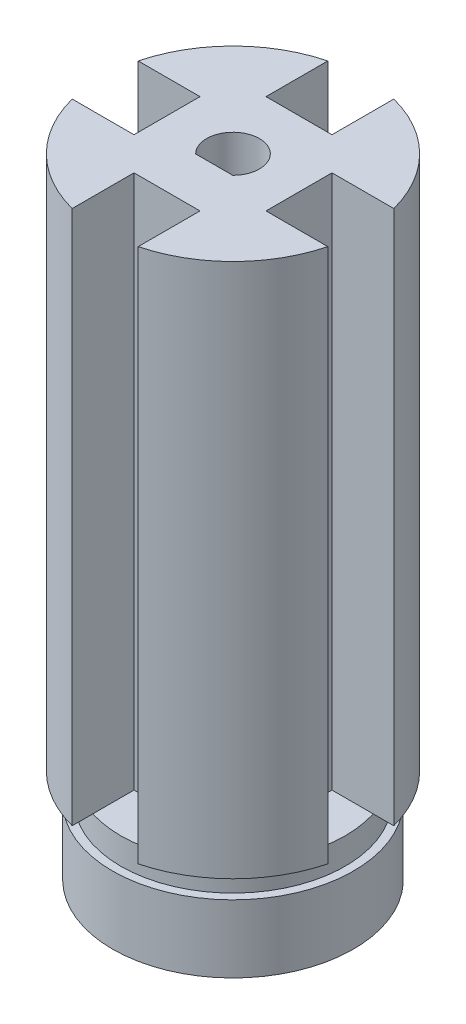
ISO-10303-21;
HEADER;
FILE_DESCRIPTION(('STEP AP214'),'2;1');
FILE_NAME('part.step','',(''),(''),'','','');
FILE_SCHEMA(('AUTOMOTIVE_DESIGN { 1 0 10303 214 1 1 1 1 }'));
ENDSEC;
DATA;
#1=APPLICATION_CONTEXT('core data for automotive mechanical design processes');
#2=APPLICATION_PROTOCOL_DEFINITION('international standard','automotive_design',2000,#1);
#3=PRODUCT_CONTEXT('',#1,'mechanical');
#4=PRODUCT('Part','Part','',(#3));
#5=PRODUCT_RELATED_PRODUCT_CATEGORY('part','',(#4));
#6=PRODUCT_DEFINITION_FORMATION('','',#4);
#7=PRODUCT_DEFINITION_CONTEXT('part definition',#1,'design');
#8=PRODUCT_DEFINITION('design','',#6,#7);
#9=PRODUCT_DEFINITION_SHAPE('','',#8);
#10=(LENGTH_UNIT() NAMED_UNIT(*) SI_UNIT(.MILLI.,.METRE.));
#11=(NAMED_UNIT(*) PLANE_ANGLE_UNIT() SI_UNIT($,.RADIAN.));
#12=(NAMED_UNIT(*) SI_UNIT($,.STERADIAN.) SOLID_ANGLE_UNIT());
#13=UNCERTAINTY_MEASURE_WITH_UNIT(LENGTH_MEASURE(1.E-05),#10,'distance_accuracy_value','');
#14=(GEOMETRIC_REPRESENTATION_CONTEXT(3) GLOBAL_UNCERTAINTY_ASSIGNED_CONTEXT((#13)) GLOBAL_UNIT_ASSIGNED_CONTEXT((#10,
#11,#12)) REPRESENTATION_CONTEXT('',''));
#15=CARTESIAN_POINT('',(0.,0.,0.));
#16=DIRECTION('',(0.,0.,1.));
#17=DIRECTION('',(1.,0.,0.));
#18=AXIS2_PLACEMENT_3D('',#15,#16,#17);
#19=CARTESIAN_POINT('',(0.,4.25499999999989,0.));
#20=DIRECTION('',(0.,1.,0.));
#21=DIRECTION('',(0.,0.,1.));
#22=AXIS2_PLACEMENT_3D('',#19,#20,#21);
#23=CYLINDRICAL_SURFACE('',#22,20.);
#24=CARTESIAN_POINT('',(0.,85.2549999999999,0.));
#25=DIRECTION('',(0.,1.,0.));
#26=DIRECTION('',(0.,0.,1.));
#27=AXIS2_PLACEMENT_3D('',#24,#25,#26);
#28=CIRCLE('',#27,20.);
#29=CARTESIAN_POINT('',(5.,85.2549999999999,19.3649167310371));
#30=VERTEX_POINT('',#29);
#31=CARTESIAN_POINT('',(19.3649167310371,85.2549999999999,5.));
#32=VERTEX_POINT('',#31);
#33=EDGE_CURVE('E221',#30,#32,#28,.T.);
#34=ORIENTED_EDGE('',*,*,#33,.F.);
#35=DIRECTION('',(0.,1.,0.));
#36=VECTOR('',#35,1.);
#37=CARTESIAN_POINT('',(5.,4.25499999999988,19.3649167310371));
#38=LINE('',#37,#36);
#39=CARTESIAN_POINT('',(5.,4.25499999999988,19.3649167310371));
#40=VERTEX_POINT('',#39);
#41=EDGE_CURVE('E216',#40,#30,#38,.T.);
#42=ORIENTED_EDGE('',*,*,#41,.F.);
#43=CARTESIAN_POINT('',(0.,4.25499999999989,0.));
#44=DIRECTION('',(0.,1.,0.));
#45=DIRECTION('',(0.,0.,1.));
#46=AXIS2_PLACEMENT_3D('',#43,#44,#45);
#47=CIRCLE('',#46,20.);
#48=CARTESIAN_POINT('',(19.3649167310371,4.25499999999988,5.));
#49=VERTEX_POINT('',#48);
#50=EDGE_CURVE('E231',#40,#49,#47,.T.);
#51=ORIENTED_EDGE('',*,*,#50,.T.);
#52=DIRECTION('',(0.,1.,0.));
#53=VECTOR('',#52,1.);
#54=CARTESIAN_POINT('',(19.3649167310371,4.25499999999988,5.));
#55=LINE('',#54,#53);
#56=EDGE_CURVE('E318',#49,#32,#55,.T.);
#57=ORIENTED_EDGE('',*,*,#56,.T.);
#58=EDGE_LOOP('',(#34,#42,#51,#57));
#59=FACE_BOUND('',#58,.T.);
#60=ADVANCED_FACE('F49',(#59),#23,.T.);
#61=DIRECTION('',(0.,1.,0.));
#62=VECTOR('',#61,1.);
#63=CARTESIAN_POINT('',(-5.,4.25499999999988,19.3649167310371));
#64=LINE('',#63,#62);
#65=CARTESIAN_POINT('',(-5.,4.25499999999988,19.3649167310371));
#66=VERTEX_POINT('',#65);
#67=CARTESIAN_POINT('',(-5.,85.2549999999999,19.3649167310371));
#68=VERTEX_POINT('',#67);
#69=EDGE_CURVE('E222',#66,#68,#64,.T.);
#70=ORIENTED_EDGE('',*,*,#69,.T.);
#71=CARTESIAN_POINT('',(-19.3649167310371,85.2549999999999,5.));
#72=VERTEX_POINT('',#71);
#73=EDGE_CURVE('E215',#72,#68,#28,.T.);
#74=ORIENTED_EDGE('',*,*,#73,.F.);
#75=DIRECTION('',(0.,1.,0.));
#76=VECTOR('',#75,1.);
#77=CARTESIAN_POINT('',(-19.3649167310371,4.25499999999988,5.));
#78=LINE('',#77,#76);
#79=CARTESIAN_POINT('',(-19.3649167310371,4.25499999999988,5.));
#80=VERTEX_POINT('',#79);
#81=EDGE_CURVE('E363',#80,#72,#78,.T.);
#82=ORIENTED_EDGE('',*,*,#81,.F.);
#83=EDGE_CURVE('E229',#80,#66,#47,.T.);
#84=ORIENTED_EDGE('',*,*,#83,.T.);
#85=EDGE_LOOP('',(#70,#74,#82,#84));
#86=FACE_BOUND('',#85,.T.);
#87=ADVANCED_FACE('F413',(#86),#23,.T.);
#88=CARTESIAN_POINT('',(19.3649167310371,4.25499999999988,-5.));
#89=VERTEX_POINT('',#88);
#90=CARTESIAN_POINT('',(5.,4.25499999999988,-19.3649167310371));
#91=VERTEX_POINT('',#90);
#92=EDGE_CURVE('E235',#89,#91,#47,.T.);
#93=ORIENTED_EDGE('',*,*,#92,.T.);
#94=DIRECTION('',(0.,1.,0.));
#95=VECTOR('',#94,1.);
#96=CARTESIAN_POINT('',(5.,4.25499999999988,-19.3649167310371));
#97=LINE('',#96,#95);
#98=CARTESIAN_POINT('',(5.,85.2549999999999,-19.3649167310371));
#99=VERTEX_POINT('',#98);
#100=EDGE_CURVE('E295',#91,#99,#97,.T.);
#101=ORIENTED_EDGE('',*,*,#100,.T.);
#102=CARTESIAN_POINT('',(19.3649167310371,85.2549999999999,-5.));
#103=VERTEX_POINT('',#102);
#104=EDGE_CURVE('E230',#103,#99,#28,.T.);
#105=ORIENTED_EDGE('',*,*,#104,.F.);
#106=DIRECTION('',(0.,1.,0.));
#107=VECTOR('',#106,1.);
#108=CARTESIAN_POINT('',(19.3649167310371,4.25499999999988,-5.));
#109=LINE('',#108,#107);
#110=EDGE_CURVE('E287',#89,#103,#109,.T.);
#111=ORIENTED_EDGE('',*,*,#110,.F.);
#112=EDGE_LOOP('',(#93,#101,#105,#111));
#113=FACE_BOUND('',#112,.T.);
#114=ADVANCED_FACE('F447',(#113),#23,.T.);
#115=DIRECTION('',(0.,1.,0.));
#116=VECTOR('',#115,1.);
#117=CARTESIAN_POINT('',(-19.3649167310371,4.25499999999988,-5.));
#118=LINE('',#117,#116);
#119=CARTESIAN_POINT('',(-19.3649167310371,4.25499999999988,-5.));
#120=VERTEX_POINT('',#119);
#121=CARTESIAN_POINT('',(-19.3649167310371,85.2549999999999,-5.));
#122=VERTEX_POINT('',#121);
#123=EDGE_CURVE('E387',#120,#122,#118,.T.);
#124=ORIENTED_EDGE('',*,*,#123,.T.);
#125=CARTESIAN_POINT('',(-5.,85.2549999999999,-19.3649167310371));
#126=VERTEX_POINT('',#125);
#127=EDGE_CURVE('E219',#126,#122,#28,.T.);
#128=ORIENTED_EDGE('',*,*,#127,.F.);
#129=DIRECTION('',(0.,1.,0.));
#130=VECTOR('',#129,1.);
#131=CARTESIAN_POINT('',(-5.,4.25499999999988,-19.3649167310371));
#132=LINE('',#131,#130);
#133=CARTESIAN_POINT('',(-5.,4.25499999999988,-19.3649167310371));
#134=VERTEX_POINT('',#133);
#135=EDGE_CURVE('E292',#134,#126,#132,.T.);
#136=ORIENTED_EDGE('',*,*,#135,.F.);
#137=EDGE_CURVE('E265',#134,#120,#47,.T.);
#138=ORIENTED_EDGE('',*,*,#137,.T.);
#139=EDGE_LOOP('',(#124,#128,#136,#138));
#140=FACE_BOUND('',#139,.T.);
#141=ADVANCED_FACE('F408',(#140),#23,.T.);
#142=CARTESIAN_POINT('',(0.,4.25499999999989,0.));
#143=DIRECTION('',(0.,1.,0.));
#144=DIRECTION('',(0.,0.,1.));
#145=AXIS2_PLACEMENT_3D('',#142,#143,#144);
#146=PLANE('',#145);
#147=DIRECTION('',(0.,0.,1.));
#148=VECTOR('',#147,1.);
#149=CARTESIAN_POINT('',(5.,4.25499999999988,0.));
#150=LINE('',#149,#148);
#151=CARTESIAN_POINT('',(5.,4.25499999999988,16.2480768092719));
#152=VERTEX_POINT('',#151);
#153=EDGE_CURVE('E345',#152,#40,#150,.T.);
#154=ORIENTED_EDGE('',*,*,#153,.F.);
#155=CARTESIAN_POINT('',(0.,4.25499999999989,0.));
#156=DIRECTION('',(0.,1.,0.));
#157=DIRECTION('',(0.,0.,1.));
#158=AXIS2_PLACEMENT_3D('',#155,#156,#157);
#159=CIRCLE('',#158,17.);
#160=CARTESIAN_POINT('',(16.2480768092719,4.25499999999989,5.));
#161=VERTEX_POINT('',#160);
#162=EDGE_CURVE('E243',#161,#152,#159,.F.);
#163=ORIENTED_EDGE('',*,*,#162,.F.);
#164=DIRECTION('',(1.,0.,0.));
#165=VECTOR('',#164,1.);
#166=CARTESIAN_POINT('',(0.,4.25499999999988,5.));
#167=LINE('',#166,#165);
#168=EDGE_CURVE('E307',#161,#49,#167,.T.);
#169=ORIENTED_EDGE('',*,*,#168,.T.);
#170=ORIENTED_EDGE('',*,*,#50,.F.);
#171=EDGE_LOOP('',(#154,#163,#169,#170));
#172=FACE_BOUND('',#171,.T.);
#173=ADVANCED_FACE('F344',(#172),#146,.F.);
#174=CARTESIAN_POINT('',(-5.,4.25499999999989,16.2480768092719));
#175=VERTEX_POINT('',#174);
#176=CARTESIAN_POINT('',(-16.2480768092719,4.25499999999988,5.));
#177=VERTEX_POINT('',#176);
#178=EDGE_CURVE('E53',#175,#177,#159,.F.);
#179=ORIENTED_EDGE('',*,*,#178,.F.);
#180=DIRECTION('',(0.,0.,1.));
#181=VECTOR('',#180,1.);
#182=CARTESIAN_POINT('',(-5.,4.25499999999988,0.));
#183=LINE('',#182,#181);
#184=EDGE_CURVE('E357',#175,#66,#183,.T.);
#185=ORIENTED_EDGE('',*,*,#184,.T.);
#186=ORIENTED_EDGE('',*,*,#83,.F.);
#187=DIRECTION('',(-1.,0.,0.));
#188=VECTOR('',#187,1.);
#189=CARTESIAN_POINT('',(0.,4.25499999999988,5.));
#190=LINE('',#189,#188);
#191=EDGE_CURVE('E374',#177,#80,#190,.T.);
#192=ORIENTED_EDGE('',*,*,#191,.F.);
#193=EDGE_LOOP('',(#179,#185,#186,#192));
#194=FACE_BOUND('',#193,.T.);
#195=ADVANCED_FACE('F417',(#194),#146,.F.);
#196=DIRECTION('',(0.,0.,1.));
#197=VECTOR('',#196,1.);
#198=CARTESIAN_POINT('',(5.,4.25499999999988,0.));
#199=LINE('',#198,#197);
#200=CARTESIAN_POINT('',(5.,4.25499999999989,-16.2480768092719));
#201=VERTEX_POINT('',#200);
#202=EDGE_CURVE('E280',#91,#201,#199,.T.);
#203=ORIENTED_EDGE('',*,*,#202,.F.);
#204=ORIENTED_EDGE('',*,*,#92,.F.);
#205=DIRECTION('',(1.,0.,0.));
#206=VECTOR('',#205,1.);
#207=CARTESIAN_POINT('',(0.,4.25499999999988,-5.));
#208=LINE('',#207,#206);
#209=CARTESIAN_POINT('',(16.2480768092719,4.25499999999988,-5.));
#210=VERTEX_POINT('',#209);
#211=EDGE_CURVE('E305',#210,#89,#208,.T.);
#212=ORIENTED_EDGE('',*,*,#211,.F.);
#213=EDGE_CURVE('E248',#201,#210,#159,.F.);
#214=ORIENTED_EDGE('',*,*,#213,.F.);
#215=EDGE_LOOP('',(#203,#204,#212,#214));
#216=FACE_BOUND('',#215,.T.);
#217=ADVANCED_FACE('F462',(#216),#146,.F.);
#218=CARTESIAN_POINT('',(-16.2480768092719,4.25499999999989,-5.));
#219=VERTEX_POINT('',#218);
#220=CARTESIAN_POINT('',(-5.,4.25499999999988,-16.2480768092719));
#221=VERTEX_POINT('',#220);
#222=EDGE_CURVE('E242',#219,#221,#159,.F.);
#223=ORIENTED_EDGE('',*,*,#222,.F.);
#224=DIRECTION('',(-1.,0.,0.));
#225=VECTOR('',#224,1.);
#226=CARTESIAN_POINT('',(0.,4.25499999999988,-5.));
#227=LINE('',#226,#225);
#228=EDGE_CURVE('E262',#219,#120,#227,.T.);
#229=ORIENTED_EDGE('',*,*,#228,.T.);
#230=ORIENTED_EDGE('',*,*,#137,.F.);
#231=DIRECTION('',(0.,0.,1.));
#232=VECTOR('',#231,1.);
#233=CARTESIAN_POINT('',(-5.,4.25499999999988,0.));
#234=LINE('',#233,#232);
#235=EDGE_CURVE('E264',#134,#221,#234,.T.);
#236=ORIENTED_EDGE('',*,*,#235,.T.);
#237=EDGE_LOOP('',(#223,#229,#230,#236));
#238=FACE_BOUND('',#237,.T.);
#239=ADVANCED_FACE('F259',(#238),#146,.F.);
#240=CARTESIAN_POINT('',(0.,85.2549999999999,0.));
#241=DIRECTION('',(0.,1.,0.));
#242=DIRECTION('',(0.,0.,1.));
#243=AXIS2_PLACEMENT_3D('',#240,#241,#242);
#244=PLANE('',#243);
#245=CARTESIAN_POINT('',(0.,85.2549999999999,0.));
#246=DIRECTION('',(0.,1.,0.));
#247=DIRECTION('',(0.,0.,1.));
#248=AXIS2_PLACEMENT_3D('',#245,#246,#247);
#249=CIRCLE('',#248,4.);
#250=CARTESIAN_POINT('',(2.80668844013724,85.2549999999999,2.85));
#251=VERTEX_POINT('',#250);
#252=CARTESIAN_POINT('',(-2.80668844013724,85.2549999999999,2.85));
#253=VERTEX_POINT('',#252);
#254=EDGE_CURVE('E213',#251,#253,#249,.T.);
#255=ORIENTED_EDGE('',*,*,#254,.F.);
#256=DIRECTION('',(1.,0.,0.));
#257=VECTOR('',#256,1.);
#258=CARTESIAN_POINT('',(0.,85.2549999999999,2.85));
#259=LINE('',#258,#257);
#260=EDGE_CURVE('E202',#253,#251,#259,.T.);
#261=ORIENTED_EDGE('',*,*,#260,.F.);
#262=EDGE_LOOP('',(#255,#261));
#263=FACE_BOUND('',#262,.T.);
#264=DIRECTION('',(1.,0.,0.));
#265=VECTOR('',#264,1.);
#266=CARTESIAN_POINT('',(0.,85.2549999999999,10.));
#267=LINE('',#266,#265);
#268=CARTESIAN_POINT('',(-5.,85.2549999999999,10.));
#269=VERTEX_POINT('',#268);
#270=CARTESIAN_POINT('',(5.,85.2549999999999,10.));
#271=VERTEX_POINT('',#270);
#272=EDGE_CURVE('E352',#269,#271,#267,.T.);
#273=ORIENTED_EDGE('',*,*,#272,.T.);
#274=DIRECTION('',(0.,0.,1.));
#275=VECTOR('',#274,1.);
#276=CARTESIAN_POINT('',(5.,85.2549999999999,0.));
#277=LINE('',#276,#275);
#278=EDGE_CURVE('E361',#271,#30,#277,.T.);
#279=ORIENTED_EDGE('',*,*,#278,.T.);
#280=ORIENTED_EDGE('',*,*,#33,.T.);
#281=DIRECTION('',(1.,0.,0.));
#282=VECTOR('',#281,1.);
#283=CARTESIAN_POINT('',(0.,85.2549999999999,5.));
#284=LINE('',#283,#282);
#285=CARTESIAN_POINT('',(9.99999673103709,85.2549999999999,5.));
#286=VERTEX_POINT('',#285);
#287=EDGE_CURVE('E315',#286,#32,#284,.T.);
#288=ORIENTED_EDGE('',*,*,#287,.F.);
#289=DIRECTION('',(0.,0.,-1.));
#290=VECTOR('',#289,1.);
#291=CARTESIAN_POINT('',(9.99999673103709,85.2549999999999,0.));
#292=LINE('',#291,#290);
#293=CARTESIAN_POINT('',(9.99999673103709,85.2549999999999,-5.));
#294=VERTEX_POINT('',#293);
#295=EDGE_CURVE('E312',#286,#294,#292,.T.);
#296=ORIENTED_EDGE('',*,*,#295,.T.);
#297=DIRECTION('',(1.,0.,0.));
#298=VECTOR('',#297,1.);
#299=CARTESIAN_POINT('',(0.,85.2549999999999,-5.));
#300=LINE('',#299,#298);
#301=EDGE_CURVE('E309',#294,#103,#300,.T.);
#302=ORIENTED_EDGE('',*,*,#301,.T.);
#303=ORIENTED_EDGE('',*,*,#104,.T.);
#304=DIRECTION('',(0.,0.,1.));
#305=VECTOR('',#304,1.);
#306=CARTESIAN_POINT('',(5.,85.2549999999999,0.));
#307=LINE('',#306,#305);
#308=CARTESIAN_POINT('',(5.,85.2549999999999,-10.));
#309=VERTEX_POINT('',#308);
#310=EDGE_CURVE('E275',#99,#309,#307,.T.);
#311=ORIENTED_EDGE('',*,*,#310,.T.);
#312=DIRECTION('',(1.,0.,0.));
#313=VECTOR('',#312,1.);
#314=CARTESIAN_POINT('',(0.,85.2549999999999,-10.));
#315=LINE('',#314,#313);
#316=CARTESIAN_POINT('',(-5.,85.2549999999999,-10.));
#317=VERTEX_POINT('',#316);
#318=EDGE_CURVE('E286',#317,#309,#315,.T.);
#319=ORIENTED_EDGE('',*,*,#318,.F.);
#320=DIRECTION('',(0.,0.,1.));
#321=VECTOR('',#320,1.);
#322=CARTESIAN_POINT('',(-5.,85.2549999999999,0.));
#323=LINE('',#322,#321);
#324=EDGE_CURVE('E283',#126,#317,#323,.T.);
#325=ORIENTED_EDGE('',*,*,#324,.F.);
#326=ORIENTED_EDGE('',*,*,#127,.T.);
#327=DIRECTION('',(-1.,0.,0.));
#328=VECTOR('',#327,1.);
#329=CARTESIAN_POINT('',(0.,85.2549999999999,-5.));
#330=LINE('',#329,#328);
#331=CARTESIAN_POINT('',(-10.,85.2549999999999,-5.));
#332=VERTEX_POINT('',#331);
#333=EDGE_CURVE('E384',#332,#122,#330,.T.);
#334=ORIENTED_EDGE('',*,*,#333,.F.);
#335=DIRECTION('',(0.,0.,-1.));
#336=VECTOR('',#335,1.);
#337=CARTESIAN_POINT('',(-10.,85.2549999999999,0.));
#338=LINE('',#337,#336);
#339=CARTESIAN_POINT('',(-10.,85.2549999999999,5.));
#340=VERTEX_POINT('',#339);
#341=EDGE_CURVE('E381',#340,#332,#338,.T.);
#342=ORIENTED_EDGE('',*,*,#341,.F.);
#343=DIRECTION('',(-1.,0.,0.));
#344=VECTOR('',#343,1.);
#345=CARTESIAN_POINT('',(0.,85.2549999999999,5.));
#346=LINE('',#345,#344);
#347=EDGE_CURVE('E294',#340,#72,#346,.T.);
#348=ORIENTED_EDGE('',*,*,#347,.T.);
#349=ORIENTED_EDGE('',*,*,#73,.T.);
#350=DIRECTION('',(0.,0.,1.));
#351=VECTOR('',#350,1.);
#352=CARTESIAN_POINT('',(-5.,85.2549999999999,0.));
#353=LINE('',#352,#351);
#354=EDGE_CURVE('E349',#269,#68,#353,.T.);
#355=ORIENTED_EDGE('',*,*,#354,.F.);
#356=EDGE_LOOP('',(#273,#279,#280,#288,#296,#302,#303,#311,#319,#325,#326,#334,#342,#348,#349,#355));
#357=FACE_BOUND('',#356,.T.);
#358=ADVANCED_FACE('F211',(#263,#357),#244,.T.);
#359=CARTESIAN_POINT('',(0.,5.25499999999989,0.));
#360=DIRECTION('',(0.,-1.,0.));
#361=DIRECTION('',(0.,0.,-1.));
#362=AXIS2_PLACEMENT_3D('',#359,#360,#361);
#363=CYLINDRICAL_SURFACE('',#362,4.);
#364=DIRECTION('',(0.,-1.,0.));
#365=VECTOR('',#364,1.);
#366=CARTESIAN_POINT('',(2.80668844013724,85.2549999999999,2.85));
#367=LINE('',#366,#365);
#368=CARTESIAN_POINT('',(2.80668844013724,0.254999999999901,2.85));
#369=VERTEX_POINT('',#368);
#370=EDGE_CURVE('E207',#251,#369,#367,.T.);
#371=ORIENTED_EDGE('',*,*,#370,.F.);
#372=ORIENTED_EDGE('',*,*,#254,.T.);
#373=DIRECTION('',(0.,-1.,0.));
#374=VECTOR('',#373,1.);
#375=CARTESIAN_POINT('',(-2.80668844013724,85.2549999999999,2.85));
#376=LINE('',#375,#374);
#377=CARTESIAN_POINT('',(-2.80668844013724,0.254999999999901,2.85));
#378=VERTEX_POINT('',#377);
#379=EDGE_CURVE('E199',#253,#378,#376,.T.);
#380=ORIENTED_EDGE('',*,*,#379,.T.);
#381=CARTESIAN_POINT('',(0.,0.254999999999901,0.));
#382=DIRECTION('',(0.,1.,0.));
#383=DIRECTION('',(0.,0.,1.));
#384=AXIS2_PLACEMENT_3D('',#381,#382,#383);
#385=CIRCLE('',#384,4.);
#386=EDGE_CURVE('E58',#369,#378,#385,.T.);
#387=ORIENTED_EDGE('',*,*,#386,.F.);
#388=EDGE_LOOP('',(#371,#372,#380,#387));
#389=FACE_BOUND('',#388,.T.);
#390=ADVANCED_FACE('F51',(#389),#363,.F.);
#391=CARTESIAN_POINT('',(0.,5.25499999999989,0.));
#392=DIRECTION('',(0.,-1.,0.));
#393=DIRECTION('',(0.,0.,-1.));
#394=AXIS2_PLACEMENT_3D('',#391,#392,#393);
#395=CYLINDRICAL_SURFACE('',#394,17.);
#396=CARTESIAN_POINT('',(0.,0.254999999999901,0.));
#397=DIRECTION('',(0.,1.,0.));
#398=DIRECTION('',(0.,0.,1.));
#399=AXIS2_PLACEMENT_3D('',#396,#397,#398);
#400=CIRCLE('',#399,17.);
#401=CARTESIAN_POINT('',(0.,0.254999999999901,17.));
#402=VERTEX_POINT('',#401);
#403=EDGE_CURVE('E12',#402,#402,#400,.F.);
#404=ORIENTED_EDGE('',*,*,#403,.F.);
#405=EDGE_LOOP('',(#404));
#406=FACE_BOUND('',#405,.T.);
#407=ORIENTED_EDGE('',*,*,#178,.T.);
#408=EDGE_CURVE('E237',#177,#219,#159,.F.);
#409=ORIENTED_EDGE('',*,*,#408,.T.);
#410=ORIENTED_EDGE('',*,*,#222,.T.);
#411=EDGE_CURVE('E250',#221,#201,#159,.F.);
#412=ORIENTED_EDGE('',*,*,#411,.T.);
#413=ORIENTED_EDGE('',*,*,#213,.T.);
#414=EDGE_CURVE('E245',#210,#161,#159,.F.);
#415=ORIENTED_EDGE('',*,*,#414,.T.);
#416=ORIENTED_EDGE('',*,*,#162,.T.);
#417=EDGE_CURVE('E234',#152,#175,#159,.F.);
#418=ORIENTED_EDGE('',*,*,#417,.T.);
#419=EDGE_LOOP('',(#407,#409,#410,#412,#413,#415,#416,#418));
#420=FACE_BOUND('',#419,.T.);
#421=ADVANCED_FACE('F255',(#406,#420),#395,.T.);
#422=CARTESIAN_POINT('',(0.,0.254999999999901,0.));
#423=DIRECTION('',(0.,1.,0.));
#424=DIRECTION('',(0.,0.,1.));
#425=AXIS2_PLACEMENT_3D('',#422,#423,#424);
#426=PLANE('',#425);
#427=ORIENTED_EDGE('',*,*,#386,.T.);
#428=DIRECTION('',(1.,0.,0.));
#429=VECTOR('',#428,1.);
#430=CARTESIAN_POINT('',(0.,0.254999999999901,2.85));
#431=LINE('',#430,#429);
#432=EDGE_CURVE('E64',#378,#369,#431,.T.);
#433=ORIENTED_EDGE('',*,*,#432,.T.);
#434=EDGE_LOOP('',(#427,#433));
#435=FACE_BOUND('',#434,.T.);
#436=ORIENTED_EDGE('',*,*,#403,.T.);
#437=EDGE_LOOP('',(#436));
#438=FACE_BOUND('',#437,.T.);
#439=ADVANCED_FACE('F492',(#435,#438),#426,.F.);
#440=CARTESIAN_POINT('',(0.,4.25499999999988,-5.));
#441=DIRECTION('',(0.,0.,1.));
#442=DIRECTION('',(1.,0.,0.));
#443=AXIS2_PLACEMENT_3D('',#440,#441,#442);
#444=PLANE('',#443);
#445=ORIENTED_EDGE('',*,*,#301,.F.);
#446=DIRECTION('',(0.,1.,0.));
#447=VECTOR('',#446,1.);
#448=CARTESIAN_POINT('',(9.99999673103709,4.25499999999988,-5.));
#449=LINE('',#448,#447);
#450=CARTESIAN_POINT('',(9.99999673103709,4.25499999999988,-5.));
#451=VERTEX_POINT('',#450);
#452=EDGE_CURVE('E225',#451,#294,#449,.T.);
#453=ORIENTED_EDGE('',*,*,#452,.F.);
#454=EDGE_CURVE('E301',#451,#210,#208,.T.);
#455=ORIENTED_EDGE('',*,*,#454,.T.);
#456=ORIENTED_EDGE('',*,*,#211,.T.);
#457=ORIENTED_EDGE('',*,*,#110,.T.);
#458=EDGE_LOOP('',(#445,#453,#455,#456,#457));
#459=FACE_BOUND('',#458,.T.);
#460=ADVANCED_FACE('F330',(#459),#444,.T.);
#461=CARTESIAN_POINT('',(0.,4.25499999999988,5.));
#462=DIRECTION('',(0.,0.,1.));
#463=DIRECTION('',(1.,0.,0.));
#464=AXIS2_PLACEMENT_3D('',#461,#462,#463);
#465=PLANE('',#464);
#466=ORIENTED_EDGE('',*,*,#287,.T.);
#467=ORIENTED_EDGE('',*,*,#56,.F.);
#468=ORIENTED_EDGE('',*,*,#168,.F.);
#469=CARTESIAN_POINT('',(9.99999673103709,4.25499999999988,5.));
#470=VERTEX_POINT('',#469);
#471=EDGE_CURVE('E72',#470,#161,#167,.T.);
#472=ORIENTED_EDGE('',*,*,#471,.F.);
#473=DIRECTION('',(0.,1.,0.));
#474=VECTOR('',#473,1.);
#475=CARTESIAN_POINT('',(9.99999673103709,4.25499999999988,5.));
#476=LINE('',#475,#474);
#477=EDGE_CURVE('E320',#470,#286,#476,.T.);
#478=ORIENTED_EDGE('',*,*,#477,.T.);
#479=EDGE_LOOP('',(#466,#467,#468,#472,#478));
#480=FACE_BOUND('',#479,.T.);
#481=ADVANCED_FACE('F337',(#480),#465,.F.);
#482=CARTESIAN_POINT('',(9.99999673103709,4.25499999999988,0.));
#483=DIRECTION('',(1.,0.,0.));
#484=DIRECTION('',(0.,0.,-1.));
#485=AXIS2_PLACEMENT_3D('',#482,#483,#484);
#486=PLANE('',#485);
#487=ORIENTED_EDGE('',*,*,#295,.F.);
#488=ORIENTED_EDGE('',*,*,#477,.F.);
#489=DIRECTION('',(0.,0.,-1.));
#490=VECTOR('',#489,1.);
#491=CARTESIAN_POINT('',(9.99999673103709,4.25499999999988,0.));
#492=LINE('',#491,#490);
#493=EDGE_CURVE('E304',#470,#451,#492,.T.);
#494=ORIENTED_EDGE('',*,*,#493,.T.);
#495=ORIENTED_EDGE('',*,*,#452,.T.);
#496=EDGE_LOOP('',(#487,#488,#494,#495));
#497=FACE_BOUND('',#496,.T.);
#498=ADVANCED_FACE('F326',(#497),#486,.T.);
#499=CARTESIAN_POINT('',(0.,4.25499999999988,0.));
#500=DIRECTION('',(0.,1.,0.));
#501=DIRECTION('',(0.,0.,1.));
#502=AXIS2_PLACEMENT_3D('',#499,#500,#501);
#503=PLANE('',#502);
#504=ORIENTED_EDGE('',*,*,#454,.F.);
#505=ORIENTED_EDGE('',*,*,#493,.F.);
#506=ORIENTED_EDGE('',*,*,#471,.T.);
#507=ORIENTED_EDGE('',*,*,#414,.F.);
#508=EDGE_LOOP('',(#504,#505,#506,#507));
#509=FACE_BOUND('',#508,.T.);
#510=ADVANCED_FACE('F476',(#509),#503,.T.);
#511=CARTESIAN_POINT('',(-5.,4.25499999999988,0.));
#512=DIRECTION('',(-1.,0.,0.));
#513=DIRECTION('',(0.,0.,1.));
#514=AXIS2_PLACEMENT_3D('',#511,#512,#513);
#515=PLANE('',#514);
#516=ORIENTED_EDGE('',*,*,#324,.T.);
#517=DIRECTION('',(0.,1.,0.));
#518=VECTOR('',#517,1.);
#519=CARTESIAN_POINT('',(-5.,4.25499999999988,-10.));
#520=LINE('',#519,#518);
#521=CARTESIAN_POINT('',(-5.,4.25499999999988,-10.));
#522=VERTEX_POINT('',#521);
#523=EDGE_CURVE('E282',#522,#317,#520,.T.);
#524=ORIENTED_EDGE('',*,*,#523,.F.);
#525=EDGE_CURVE('E270',#221,#522,#234,.T.);
#526=ORIENTED_EDGE('',*,*,#525,.F.);
#527=ORIENTED_EDGE('',*,*,#235,.F.);
#528=ORIENTED_EDGE('',*,*,#135,.T.);
#529=EDGE_LOOP('',(#516,#524,#526,#527,#528));
#530=FACE_BOUND('',#529,.T.);
#531=ADVANCED_FACE('F474',(#530),#515,.F.);
#532=CARTESIAN_POINT('',(5.,4.25499999999988,0.));
#533=DIRECTION('',(-1.,0.,0.));
#534=DIRECTION('',(0.,0.,1.));
#535=AXIS2_PLACEMENT_3D('',#532,#533,#534);
#536=PLANE('',#535);
#537=ORIENTED_EDGE('',*,*,#310,.F.);
#538=ORIENTED_EDGE('',*,*,#100,.F.);
#539=ORIENTED_EDGE('',*,*,#202,.T.);
#540=CARTESIAN_POINT('',(5.,4.25499999999988,-10.));
#541=VERTEX_POINT('',#540);
#542=EDGE_CURVE('E273',#201,#541,#199,.T.);
#543=ORIENTED_EDGE('',*,*,#542,.T.);
#544=DIRECTION('',(0.,1.,0.));
#545=VECTOR('',#544,1.);
#546=CARTESIAN_POINT('',(5.,4.25499999999988,-10.));
#547=LINE('',#546,#545);
#548=EDGE_CURVE('E298',#541,#309,#547,.T.);
#549=ORIENTED_EDGE('',*,*,#548,.T.);
#550=EDGE_LOOP('',(#537,#538,#539,#543,#549));
#551=FACE_BOUND('',#550,.T.);
#552=ADVANCED_FACE('F465',(#551),#536,.T.);
#553=CARTESIAN_POINT('',(0.,4.25499999999988,-10.));
#554=DIRECTION('',(0.,0.,1.));
#555=DIRECTION('',(1.,0.,0.));
#556=AXIS2_PLACEMENT_3D('',#553,#554,#555);
#557=PLANE('',#556);
#558=ORIENTED_EDGE('',*,*,#318,.T.);
#559=ORIENTED_EDGE('',*,*,#548,.F.);
#560=DIRECTION('',(1.,0.,0.));
#561=VECTOR('',#560,1.);
#562=CARTESIAN_POINT('',(0.,4.25499999999988,-10.));
#563=LINE('',#562,#561);
#564=EDGE_CURVE('E269',#522,#541,#563,.T.);
#565=ORIENTED_EDGE('',*,*,#564,.F.);
#566=ORIENTED_EDGE('',*,*,#523,.T.);
#567=EDGE_LOOP('',(#558,#559,#565,#566));
#568=FACE_BOUND('',#567,.T.);
#569=ADVANCED_FACE('F472',(#568),#557,.F.);
#570=CARTESIAN_POINT('',(0.,4.25499999999988,0.));
#571=DIRECTION('',(0.,1.,0.));
#572=DIRECTION('',(0.,0.,1.));
#573=AXIS2_PLACEMENT_3D('',#570,#571,#572);
#574=PLANE('',#573);
#575=ORIENTED_EDGE('',*,*,#525,.T.);
#576=ORIENTED_EDGE('',*,*,#564,.T.);
#577=ORIENTED_EDGE('',*,*,#542,.F.);
#578=ORIENTED_EDGE('',*,*,#411,.F.);
#579=EDGE_LOOP('',(#575,#576,#577,#578));
#580=FACE_BOUND('',#579,.T.);
#581=ADVANCED_FACE('F468',(#580),#574,.T.);
#582=CARTESIAN_POINT('',(0.,4.25499999999988,5.));
#583=DIRECTION('',(0.,0.,-1.));
#584=DIRECTION('',(-1.,0.,0.));
#585=AXIS2_PLACEMENT_3D('',#582,#583,#584);
#586=PLANE('',#585);
#587=ORIENTED_EDGE('',*,*,#347,.F.);
#588=DIRECTION('',(0.,1.,0.));
#589=VECTOR('',#588,1.);
#590=CARTESIAN_POINT('',(-10.,4.25499999999988,5.));
#591=LINE('',#590,#589);
#592=CARTESIAN_POINT('',(-10.,4.25499999999988,5.));
#593=VERTEX_POINT('',#592);
#594=EDGE_CURVE('E277',#593,#340,#591,.T.);
#595=ORIENTED_EDGE('',*,*,#594,.F.);
#596=EDGE_CURVE('E370',#593,#177,#190,.T.);
#597=ORIENTED_EDGE('',*,*,#596,.T.);
#598=ORIENTED_EDGE('',*,*,#191,.T.);
#599=ORIENTED_EDGE('',*,*,#81,.T.);
#600=EDGE_LOOP('',(#587,#595,#597,#598,#599));
#601=FACE_BOUND('',#600,.T.);
#602=ADVANCED_FACE('F400',(#601),#586,.T.);
#603=CARTESIAN_POINT('',(0.,4.25499999999988,-5.));
#604=DIRECTION('',(0.,0.,-1.));
#605=DIRECTION('',(-1.,0.,0.));
#606=AXIS2_PLACEMENT_3D('',#603,#604,#605);
#607=PLANE('',#606);
#608=ORIENTED_EDGE('',*,*,#333,.T.);
#609=ORIENTED_EDGE('',*,*,#123,.F.);
#610=ORIENTED_EDGE('',*,*,#228,.F.);
#611=CARTESIAN_POINT('',(-10.,4.25499999999988,-5.));
#612=VERTEX_POINT('',#611);
#613=EDGE_CURVE('E377',#612,#219,#227,.T.);
#614=ORIENTED_EDGE('',*,*,#613,.F.);
#615=DIRECTION('',(0.,1.,0.));
#616=VECTOR('',#615,1.);
#617=CARTESIAN_POINT('',(-10.,4.25499999999988,-5.));
#618=LINE('',#617,#616);
#619=EDGE_CURVE('E389',#612,#332,#618,.T.);
#620=ORIENTED_EDGE('',*,*,#619,.T.);
#621=EDGE_LOOP('',(#608,#609,#610,#614,#620));
#622=FACE_BOUND('',#621,.T.);
#623=ADVANCED_FACE('F406',(#622),#607,.F.);
#624=CARTESIAN_POINT('',(-10.,4.25499999999988,0.));
#625=DIRECTION('',(1.,0.,0.));
#626=DIRECTION('',(0.,0.,-1.));
#627=AXIS2_PLACEMENT_3D('',#624,#625,#626);
#628=PLANE('',#627);
#629=ORIENTED_EDGE('',*,*,#341,.T.);
#630=ORIENTED_EDGE('',*,*,#619,.F.);
#631=DIRECTION('',(0.,0.,-1.));
#632=VECTOR('',#631,1.);
#633=CARTESIAN_POINT('',(-10.,4.25499999999988,0.));
#634=LINE('',#633,#632);
#635=EDGE_CURVE('E373',#593,#612,#634,.T.);
#636=ORIENTED_EDGE('',*,*,#635,.F.);
#637=ORIENTED_EDGE('',*,*,#594,.T.);
#638=EDGE_LOOP('',(#629,#630,#636,#637));
#639=FACE_BOUND('',#638,.T.);
#640=ADVANCED_FACE('F395',(#639),#628,.F.);
#641=CARTESIAN_POINT('',(0.,4.25499999999988,0.));
#642=DIRECTION('',(0.,1.,0.));
#643=DIRECTION('',(0.,0.,1.));
#644=AXIS2_PLACEMENT_3D('',#641,#642,#643);
#645=PLANE('',#644);
#646=ORIENTED_EDGE('',*,*,#596,.F.);
#647=ORIENTED_EDGE('',*,*,#635,.T.);
#648=ORIENTED_EDGE('',*,*,#613,.T.);
#649=ORIENTED_EDGE('',*,*,#408,.F.);
#650=EDGE_LOOP('',(#646,#647,#648,#649));
#651=FACE_BOUND('',#650,.T.);
#652=ADVANCED_FACE('F432',(#651),#645,.T.);
#653=CARTESIAN_POINT('',(5.,4.25499999999988,0.));
#654=DIRECTION('',(-1.,0.,0.));
#655=DIRECTION('',(0.,0.,1.));
#656=AXIS2_PLACEMENT_3D('',#653,#654,#655);
#657=PLANE('',#656);
#658=ORIENTED_EDGE('',*,*,#278,.F.);
#659=DIRECTION('',(0.,1.,0.));
#660=VECTOR('',#659,1.);
#661=CARTESIAN_POINT('',(5.,4.25499999999988,10.));
#662=LINE('',#661,#660);
#663=CARTESIAN_POINT('',(5.,4.25499999999988,10.));
#664=VERTEX_POINT('',#663);
#665=EDGE_CURVE('E360',#664,#271,#662,.T.);
#666=ORIENTED_EDGE('',*,*,#665,.F.);
#667=EDGE_CURVE('E348',#664,#152,#150,.T.);
#668=ORIENTED_EDGE('',*,*,#667,.T.);
#669=ORIENTED_EDGE('',*,*,#153,.T.);
#670=ORIENTED_EDGE('',*,*,#41,.T.);
#671=EDGE_LOOP('',(#658,#666,#668,#669,#670));
#672=FACE_BOUND('',#671,.T.);
#673=ADVANCED_FACE('F430',(#672),#657,.T.);
#674=CARTESIAN_POINT('',(-5.,4.25499999999988,0.));
#675=DIRECTION('',(-1.,0.,0.));
#676=DIRECTION('',(0.,0.,1.));
#677=AXIS2_PLACEMENT_3D('',#674,#675,#676);
#678=PLANE('',#677);
#679=ORIENTED_EDGE('',*,*,#354,.T.);
#680=ORIENTED_EDGE('',*,*,#69,.F.);
#681=ORIENTED_EDGE('',*,*,#184,.F.);
#682=CARTESIAN_POINT('',(-5.,4.25499999999988,10.));
#683=VERTEX_POINT('',#682);
#684=EDGE_CURVE('E358',#683,#175,#183,.T.);
#685=ORIENTED_EDGE('',*,*,#684,.F.);
#686=DIRECTION('',(0.,1.,0.));
#687=VECTOR('',#686,1.);
#688=CARTESIAN_POINT('',(-5.,4.25499999999988,10.));
#689=LINE('',#688,#687);
#690=EDGE_CURVE('E367',#683,#269,#689,.T.);
#691=ORIENTED_EDGE('',*,*,#690,.T.);
#692=EDGE_LOOP('',(#679,#680,#681,#685,#691));
#693=FACE_BOUND('',#692,.T.);
#694=ADVANCED_FACE('F421',(#693),#678,.F.);
#695=CARTESIAN_POINT('',(0.,4.25499999999988,10.));
#696=DIRECTION('',(0.,0.,1.));
#697=DIRECTION('',(1.,0.,0.));
#698=AXIS2_PLACEMENT_3D('',#695,#696,#697);
#699=PLANE('',#698);
#700=ORIENTED_EDGE('',*,*,#272,.F.);
#701=ORIENTED_EDGE('',*,*,#690,.F.);
#702=DIRECTION('',(1.,0.,0.));
#703=VECTOR('',#702,1.);
#704=CARTESIAN_POINT('',(0.,4.25499999999988,10.));
#705=LINE('',#704,#703);
#706=EDGE_CURVE('E351',#683,#664,#705,.T.);
#707=ORIENTED_EDGE('',*,*,#706,.T.);
#708=ORIENTED_EDGE('',*,*,#665,.T.);
#709=EDGE_LOOP('',(#700,#701,#707,#708));
#710=FACE_BOUND('',#709,.T.);
#711=ADVANCED_FACE('F426',(#710),#699,.T.);
#712=CARTESIAN_POINT('',(0.,4.25499999999988,0.));
#713=DIRECTION('',(0.,1.,0.));
#714=DIRECTION('',(0.,0.,1.));
#715=AXIS2_PLACEMENT_3D('',#712,#713,#714);
#716=PLANE('',#715);
#717=ORIENTED_EDGE('',*,*,#667,.F.);
#718=ORIENTED_EDGE('',*,*,#706,.F.);
#719=ORIENTED_EDGE('',*,*,#684,.T.);
#720=ORIENTED_EDGE('',*,*,#417,.F.);
#721=EDGE_LOOP('',(#717,#718,#719,#720));
#722=FACE_BOUND('',#721,.T.);
#723=ADVANCED_FACE('F622',(#722),#716,.T.);
#724=CARTESIAN_POINT('',(0.,85.2549999999999,2.85));
#725=DIRECTION('',(0.,0.,-1.));
#726=DIRECTION('',(-1.,0.,0.));
#727=AXIS2_PLACEMENT_3D('',#724,#725,#726);
#728=PLANE('',#727);
#729=ORIENTED_EDGE('',*,*,#432,.F.);
#730=ORIENTED_EDGE('',*,*,#379,.F.);
#731=ORIENTED_EDGE('',*,*,#260,.T.);
#732=ORIENTED_EDGE('',*,*,#370,.T.);
#733=EDGE_LOOP('',(#729,#730,#731,#732));
#734=FACE_BOUND('',#733,.T.);
#735=ADVANCED_FACE('F201',(#734),#728,.T.);
#736=CLOSED_SHELL('',(#60,#87,#114,#141,#173,#195,#217,#239,#358,#390,#421,#439,#460,#481,#498,
#510,#531,#552,#569,#581,#602,#623,#640,#652,#673,#694,#711,#723,#735));
#737=MANIFOLD_SOLID_BREP('B2',#736);
#738=CARTESIAN_POINT('',(0.,-10.,0.));
#739=DIRECTION('',(0.,1.,0.));
#740=DIRECTION('',(0.,0.,1.));
#741=AXIS2_PLACEMENT_3D('',#738,#739,#740);
#742=CYLINDRICAL_SURFACE('',#741,18.25);
#743=CARTESIAN_POINT('',(0.,-10.,0.));
#744=DIRECTION('',(0.,1.,0.));
#745=DIRECTION('',(0.,0.,1.));
#746=AXIS2_PLACEMENT_3D('',#743,#744,#745);
#747=CIRCLE('',#746,18.25);
#748=CARTESIAN_POINT('',(0.,-10.,18.25));
#749=VERTEX_POINT('',#748);
#750=EDGE_CURVE('E48',#749,#749,#747,.T.);
#751=ORIENTED_EDGE('',*,*,#750,.T.);
#752=EDGE_LOOP('',(#751));
#753=FACE_BOUND('',#752,.T.);
#754=CARTESIAN_POINT('',(0.,0.254999999999901,0.));
#755=DIRECTION('',(0.,1.,0.));
#756=DIRECTION('',(0.,0.,1.));
#757=AXIS2_PLACEMENT_3D('',#754,#755,#756);
#758=CIRCLE('',#757,18.25);
#759=CARTESIAN_POINT('',(0.,0.254999999999901,18.25));
#760=VERTEX_POINT('',#759);
#761=EDGE_CURVE('E718',#760,#760,#758,.T.);
#762=ORIENTED_EDGE('',*,*,#761,.F.);
#763=EDGE_LOOP('',(#762));
#764=FACE_BOUND('',#763,.T.);
#765=ADVANCED_FACE('F708',(#753,#764),#742,.T.);
#766=CARTESIAN_POINT('',(0.,-10.,0.));
#767=DIRECTION('',(0.,1.,0.));
#768=DIRECTION('',(0.,0.,1.));
#769=AXIS2_PLACEMENT_3D('',#766,#767,#768);
#770=PLANE('',#769);
#771=CARTESIAN_POINT('',(0.,-10.,0.));
#772=DIRECTION('',(0.,1.,0.));
#773=DIRECTION('',(0.,0.,1.));
#774=AXIS2_PLACEMENT_3D('',#771,#772,#773);
#775=CIRCLE('',#774,17.);
#776=CARTESIAN_POINT('',(0.,-10.,17.));
#777=VERTEX_POINT('',#776);
#778=EDGE_CURVE('E714',#777,#777,#775,.T.);
#779=ORIENTED_EDGE('',*,*,#778,.T.);
#780=EDGE_LOOP('',(#779));
#781=FACE_BOUND('',#780,.T.);
#782=ORIENTED_EDGE('',*,*,#750,.F.);
#783=EDGE_LOOP('',(#782));
#784=FACE_BOUND('',#783,.T.);
#785=ADVANCED_FACE('F737',(#781,#784),#770,.F.);
#786=CARTESIAN_POINT('',(0.,-10.,0.));
#787=DIRECTION('',(0.,1.,0.));
#788=DIRECTION('',(0.,0.,1.));
#789=AXIS2_PLACEMENT_3D('',#786,#787,#788);
#790=CYLINDRICAL_SURFACE('',#789,17.);
#791=ORIENTED_EDGE('',*,*,#778,.F.);
#792=EDGE_LOOP('',(#791));
#793=FACE_BOUND('',#792,.T.);
#794=CARTESIAN_POINT('',(0.,0.254999999999901,0.));
#795=DIRECTION('',(0.,1.,0.));
#796=DIRECTION('',(0.,0.,1.));
#797=AXIS2_PLACEMENT_3D('',#794,#795,#796);
#798=CIRCLE('',#797,17.);
#799=CARTESIAN_POINT('',(0.,0.254999999999901,17.));
#800=VERTEX_POINT('',#799);
#801=EDGE_CURVE('E722',#800,#800,#798,.T.);
#802=ORIENTED_EDGE('',*,*,#801,.T.);
#803=EDGE_LOOP('',(#802));
#804=FACE_BOUND('',#803,.T.);
#805=ADVANCED_FACE('F728',(#793,#804),#790,.F.);
#806=CARTESIAN_POINT('',(0.,0.254999999999901,0.));
#807=DIRECTION('',(0.,1.,0.));
#808=DIRECTION('',(0.,0.,1.));
#809=AXIS2_PLACEMENT_3D('',#806,#807,#808);
#810=PLANE('',#809);
#811=ORIENTED_EDGE('',*,*,#761,.T.);
#812=EDGE_LOOP('',(#811));
#813=FACE_BOUND('',#812,.T.);
#814=ORIENTED_EDGE('',*,*,#801,.F.);
#815=EDGE_LOOP('',(#814));
#816=FACE_BOUND('',#815,.T.);
#817=ADVANCED_FACE('F730',(#813,#816),#810,.T.);
#818=CLOSED_SHELL('',(#765,#785,#805,#817));
#819=MANIFOLD_SOLID_BREP('B6',#818);
#820=ADVANCED_BREP_SHAPE_REPRESENTATION('',(#18,#737,#819),#14);
#821=SHAPE_DEFINITION_REPRESENTATION(#9,#820);
ENDSEC;
END-ISO-10303-21;
